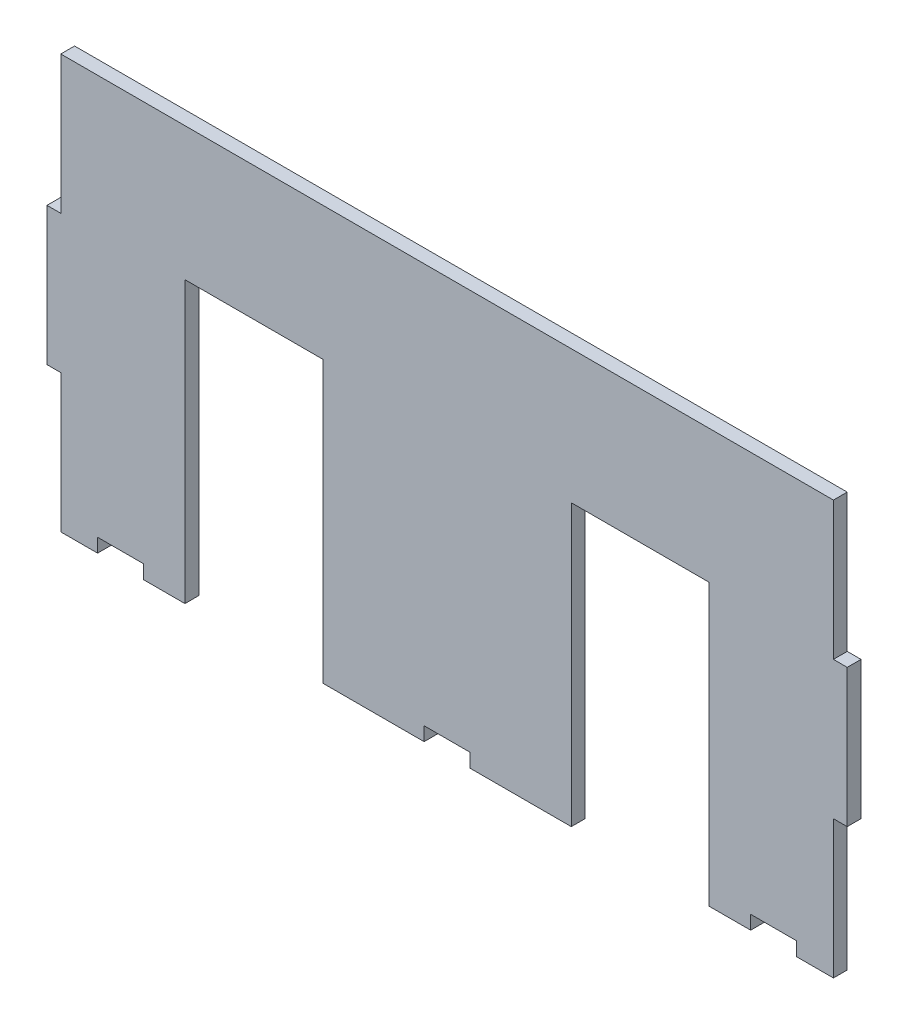
ISO-10303-21;
HEADER;
FILE_DESCRIPTION(('STEP AP214'),'2;1');
FILE_NAME('part.step','',(''),(''),'','','');
FILE_SCHEMA(('AUTOMOTIVE_DESIGN { 1 0 10303 214 1 1 1 1 }'));
ENDSEC;
DATA;
#1=APPLICATION_CONTEXT('core data for automotive mechanical design processes');
#2=APPLICATION_PROTOCOL_DEFINITION('international standard','automotive_design',2000,#1);
#3=PRODUCT_CONTEXT('',#1,'mechanical');
#4=PRODUCT('Part','Part','',(#3));
#5=PRODUCT_RELATED_PRODUCT_CATEGORY('part','',(#4));
#6=PRODUCT_DEFINITION_FORMATION('','',#4);
#7=PRODUCT_DEFINITION_CONTEXT('part definition',#1,'design');
#8=PRODUCT_DEFINITION('design','',#6,#7);
#9=PRODUCT_DEFINITION_SHAPE('','',#8);
#10=(LENGTH_UNIT() NAMED_UNIT(*) SI_UNIT(.MILLI.,.METRE.));
#11=(NAMED_UNIT(*) PLANE_ANGLE_UNIT() SI_UNIT($,.RADIAN.));
#12=(NAMED_UNIT(*) SI_UNIT($,.STERADIAN.) SOLID_ANGLE_UNIT());
#13=UNCERTAINTY_MEASURE_WITH_UNIT(LENGTH_MEASURE(1.E-05),#10,'distance_accuracy_value','');
#14=(GEOMETRIC_REPRESENTATION_CONTEXT(3) GLOBAL_UNCERTAINTY_ASSIGNED_CONTEXT((#13)) GLOBAL_UNIT_ASSIGNED_CONTEXT((#10,
#11,#12)) REPRESENTATION_CONTEXT('',''));
#15=CARTESIAN_POINT('',(0.,0.,0.));
#16=DIRECTION('',(0.,0.,1.));
#17=DIRECTION('',(1.,0.,0.));
#18=AXIS2_PLACEMENT_3D('',#15,#16,#17);
#19=CARTESIAN_POINT('',(322.190497343663,200.123752973223,3.));
#20=DIRECTION('',(0.,1.,0.));
#21=DIRECTION('',(-1.,0.,0.));
#22=AXIS2_PLACEMENT_3D('',#19,#20,#21);
#23=PLANE('',#22);
#24=DIRECTION('',(1.,0.,0.));
#25=VECTOR('',#24,1.);
#26=CARTESIAN_POINT('',(322.190497343663,200.123752973223,0.));
#27=LINE('',#26,#25);
#28=CARTESIAN_POINT('',(292.190497343663,200.123752973223,0.));
#29=VERTEX_POINT('',#28);
#30=CARTESIAN_POINT('',(322.190497343663,200.123752973223,0.));
#31=VERTEX_POINT('',#30);
#32=EDGE_CURVE('E273',#29,#31,#27,.T.);
#33=ORIENTED_EDGE('',*,*,#32,.T.);
#34=DIRECTION('',(0.,0.,-1.));
#35=VECTOR('',#34,1.);
#36=CARTESIAN_POINT('',(322.190497343663,200.123752973223,3.));
#37=LINE('',#36,#35);
#38=CARTESIAN_POINT('',(322.190497343663,200.123752973223,3.));
#39=VERTEX_POINT('',#38);
#40=EDGE_CURVE('E11',#39,#31,#37,.T.);
#41=ORIENTED_EDGE('',*,*,#40,.F.);
#42=DIRECTION('',(1.,0.,0.));
#43=VECTOR('',#42,1.);
#44=CARTESIAN_POINT('',(322.190497343663,200.123752973223,3.));
#45=LINE('',#44,#43);
#46=CARTESIAN_POINT('',(292.190497343663,200.123752973223,3.));
#47=VERTEX_POINT('',#46);
#48=EDGE_CURVE('E335',#47,#39,#45,.T.);
#49=ORIENTED_EDGE('',*,*,#48,.F.);
#50=DIRECTION('',(0.,0.,-1.));
#51=VECTOR('',#50,1.);
#52=CARTESIAN_POINT('',(292.190497343663,200.123752973223,3.));
#53=LINE('',#52,#51);
#54=EDGE_CURVE('E269',#47,#29,#53,.T.);
#55=ORIENTED_EDGE('',*,*,#54,.T.);
#56=EDGE_LOOP('',(#33,#41,#49,#55));
#57=FACE_BOUND('',#56,.T.);
#58=ADVANCED_FACE('F33',(#57),#23,.F.);
#59=CARTESIAN_POINT('',(322.190497343663,139.123752973223,3.));
#60=DIRECTION('',(1.,0.,0.));
#61=DIRECTION('',(0.,0.,-1.));
#62=AXIS2_PLACEMENT_3D('',#59,#60,#61);
#63=PLANE('',#62);
#64=DIRECTION('',(0.,-1.,0.));
#65=VECTOR('',#64,1.);
#66=CARTESIAN_POINT('',(322.190497343663,139.123752973223,0.));
#67=LINE('',#66,#65);
#68=CARTESIAN_POINT('',(322.190497343663,139.123752973223,0.));
#69=VERTEX_POINT('',#68);
#70=EDGE_CURVE('E276',#31,#69,#67,.T.);
#71=ORIENTED_EDGE('',*,*,#70,.T.);
#72=DIRECTION('',(0.,0.,-1.));
#73=VECTOR('',#72,1.);
#74=CARTESIAN_POINT('',(322.190497343663,139.123752973223,3.));
#75=LINE('',#74,#73);
#76=CARTESIAN_POINT('',(322.190497343663,139.123752973223,3.));
#77=VERTEX_POINT('',#76);
#78=EDGE_CURVE('E41',#77,#69,#75,.T.);
#79=ORIENTED_EDGE('',*,*,#78,.F.);
#80=DIRECTION('',(0.,-1.,0.));
#81=VECTOR('',#80,1.);
#82=CARTESIAN_POINT('',(322.190497343663,139.123752973223,3.));
#83=LINE('',#82,#81);
#84=EDGE_CURVE('E164',#39,#77,#83,.T.);
#85=ORIENTED_EDGE('',*,*,#84,.F.);
#86=ORIENTED_EDGE('',*,*,#40,.T.);
#87=EDGE_LOOP('',(#71,#79,#85,#86));
#88=FACE_BOUND('',#87,.T.);
#89=ADVANCED_FACE('F513',(#88),#63,.F.);
#90=CARTESIAN_POINT('',(322.190497343663,139.123752973223,3.));
#91=DIRECTION('',(0.,1.,0.));
#92=DIRECTION('',(-1.,0.,0.));
#93=AXIS2_PLACEMENT_3D('',#90,#91,#92);
#94=PLANE('',#93);
#95=DIRECTION('',(1.,0.,0.));
#96=VECTOR('',#95,1.);
#97=CARTESIAN_POINT('',(322.190497343663,139.123752973223,0.));
#98=LINE('',#97,#96);
#99=CARTESIAN_POINT('',(331.190497343663,139.123752973223,0.));
#100=VERTEX_POINT('',#99);
#101=EDGE_CURVE('E278',#69,#100,#98,.T.);
#102=ORIENTED_EDGE('',*,*,#101,.T.);
#103=DIRECTION('',(0.,0.,-1.));
#104=VECTOR('',#103,1.);
#105=CARTESIAN_POINT('',(331.190497343663,139.123752973223,3.));
#106=LINE('',#105,#104);
#107=CARTESIAN_POINT('',(331.190497343663,139.123752973223,3.));
#108=VERTEX_POINT('',#107);
#109=EDGE_CURVE('E414',#108,#100,#106,.T.);
#110=ORIENTED_EDGE('',*,*,#109,.F.);
#111=DIRECTION('',(1.,0.,0.));
#112=VECTOR('',#111,1.);
#113=CARTESIAN_POINT('',(322.190497343663,139.123752973223,3.));
#114=LINE('',#113,#112);
#115=EDGE_CURVE('E422',#77,#108,#114,.T.);
#116=ORIENTED_EDGE('',*,*,#115,.F.);
#117=ORIENTED_EDGE('',*,*,#78,.T.);
#118=EDGE_LOOP('',(#102,#110,#116,#117));
#119=FACE_BOUND('',#118,.T.);
#120=ADVANCED_FACE('F420',(#119),#94,.F.);
#121=CARTESIAN_POINT('',(331.190497343663,139.123752973223,3.));
#122=DIRECTION('',(-1.,0.,0.));
#123=DIRECTION('',(0.,0.,1.));
#124=AXIS2_PLACEMENT_3D('',#121,#122,#123);
#125=PLANE('',#124);
#126=DIRECTION('',(0.,1.,0.));
#127=VECTOR('',#126,1.);
#128=CARTESIAN_POINT('',(331.190497343663,139.123752973223,0.));
#129=LINE('',#128,#127);
#130=CARTESIAN_POINT('',(331.190497343663,142.123752973223,0.));
#131=VERTEX_POINT('',#130);
#132=EDGE_CURVE('E280',#100,#131,#129,.T.);
#133=ORIENTED_EDGE('',*,*,#132,.T.);
#134=DIRECTION('',(0.,0.,-1.));
#135=VECTOR('',#134,1.);
#136=CARTESIAN_POINT('',(331.190497343663,142.123752973223,3.));
#137=LINE('',#136,#135);
#138=CARTESIAN_POINT('',(331.190497343663,142.123752973223,3.));
#139=VERTEX_POINT('',#138);
#140=EDGE_CURVE('E411',#139,#131,#137,.T.);
#141=ORIENTED_EDGE('',*,*,#140,.F.);
#142=DIRECTION('',(0.,1.,0.));
#143=VECTOR('',#142,1.);
#144=CARTESIAN_POINT('',(331.190497343663,139.123752973223,3.));
#145=LINE('',#144,#143);
#146=EDGE_CURVE('E440',#108,#139,#145,.T.);
#147=ORIENTED_EDGE('',*,*,#146,.F.);
#148=ORIENTED_EDGE('',*,*,#109,.T.);
#149=EDGE_LOOP('',(#133,#141,#147,#148));
#150=FACE_BOUND('',#149,.T.);
#151=ADVANCED_FACE('F431',(#150),#125,.F.);
#152=CARTESIAN_POINT('',(331.190497343663,142.123752973223,3.));
#153=DIRECTION('',(0.,1.,0.));
#154=DIRECTION('',(-1.,0.,0.));
#155=AXIS2_PLACEMENT_3D('',#152,#153,#154);
#156=PLANE('',#155);
#157=DIRECTION('',(1.,0.,0.));
#158=VECTOR('',#157,1.);
#159=CARTESIAN_POINT('',(331.190497343663,142.123752973223,0.));
#160=LINE('',#159,#158);
#161=CARTESIAN_POINT('',(341.190497343663,142.123752973223,0.));
#162=VERTEX_POINT('',#161);
#163=EDGE_CURVE('E282',#131,#162,#160,.T.);
#164=ORIENTED_EDGE('',*,*,#163,.T.);
#165=DIRECTION('',(0.,0.,-1.));
#166=VECTOR('',#165,1.);
#167=CARTESIAN_POINT('',(341.190497343663,142.123752973223,3.));
#168=LINE('',#167,#166);
#169=CARTESIAN_POINT('',(341.190497343663,142.123752973223,3.));
#170=VERTEX_POINT('',#169);
#171=EDGE_CURVE('E408',#170,#162,#168,.T.);
#172=ORIENTED_EDGE('',*,*,#171,.F.);
#173=DIRECTION('',(1.,0.,0.));
#174=VECTOR('',#173,1.);
#175=CARTESIAN_POINT('',(331.190497343663,142.123752973223,3.));
#176=LINE('',#175,#174);
#177=EDGE_CURVE('E437',#139,#170,#176,.T.);
#178=ORIENTED_EDGE('',*,*,#177,.F.);
#179=ORIENTED_EDGE('',*,*,#140,.T.);
#180=EDGE_LOOP('',(#164,#172,#178,#179));
#181=FACE_BOUND('',#180,.T.);
#182=ADVANCED_FACE('F435',(#181),#156,.F.);
#183=CARTESIAN_POINT('',(341.190497343663,142.123752973223,3.));
#184=DIRECTION('',(1.,0.,0.));
#185=DIRECTION('',(0.,0.,-1.));
#186=AXIS2_PLACEMENT_3D('',#183,#184,#185);
#187=PLANE('',#186);
#188=DIRECTION('',(0.,-1.,0.));
#189=VECTOR('',#188,1.);
#190=CARTESIAN_POINT('',(341.190497343663,142.123752973223,0.));
#191=LINE('',#190,#189);
#192=CARTESIAN_POINT('',(341.190497343663,139.123752973223,0.));
#193=VERTEX_POINT('',#192);
#194=EDGE_CURVE('E284',#162,#193,#191,.T.);
#195=ORIENTED_EDGE('',*,*,#194,.T.);
#196=DIRECTION('',(0.,0.,-1.));
#197=VECTOR('',#196,1.);
#198=CARTESIAN_POINT('',(341.190497343663,139.123752973223,3.));
#199=LINE('',#198,#197);
#200=CARTESIAN_POINT('',(341.190497343663,139.123752973223,3.));
#201=VERTEX_POINT('',#200);
#202=EDGE_CURVE('E405',#201,#193,#199,.T.);
#203=ORIENTED_EDGE('',*,*,#202,.F.);
#204=DIRECTION('',(0.,-1.,0.));
#205=VECTOR('',#204,1.);
#206=CARTESIAN_POINT('',(341.190497343663,142.123752973223,3.));
#207=LINE('',#206,#205);
#208=EDGE_CURVE('E439',#170,#201,#207,.T.);
#209=ORIENTED_EDGE('',*,*,#208,.F.);
#210=ORIENTED_EDGE('',*,*,#171,.T.);
#211=EDGE_LOOP('',(#195,#203,#209,#210));
#212=FACE_BOUND('',#211,.T.);
#213=ADVANCED_FACE('F526',(#212),#187,.F.);
#214=CARTESIAN_POINT('',(341.190497343663,139.123752973223,3.));
#215=DIRECTION('',(0.,1.,0.));
#216=DIRECTION('',(-1.,0.,0.));
#217=AXIS2_PLACEMENT_3D('',#214,#215,#216);
#218=PLANE('',#217);
#219=DIRECTION('',(1.,0.,0.));
#220=VECTOR('',#219,1.);
#221=CARTESIAN_POINT('',(341.190497343663,139.123752973223,0.));
#222=LINE('',#221,#220);
#223=CARTESIAN_POINT('',(349.190497343663,139.123752973223,0.));
#224=VERTEX_POINT('',#223);
#225=EDGE_CURVE('E286',#193,#224,#222,.T.);
#226=ORIENTED_EDGE('',*,*,#225,.T.);
#227=DIRECTION('',(0.,0.,-1.));
#228=VECTOR('',#227,1.);
#229=CARTESIAN_POINT('',(349.190497343663,139.123752973223,3.));
#230=LINE('',#229,#228);
#231=CARTESIAN_POINT('',(349.190497343663,139.123752973223,3.));
#232=VERTEX_POINT('',#231);
#233=EDGE_CURVE('E402',#232,#224,#230,.T.);
#234=ORIENTED_EDGE('',*,*,#233,.F.);
#235=DIRECTION('',(1.,0.,0.));
#236=VECTOR('',#235,1.);
#237=CARTESIAN_POINT('',(341.190497343663,139.123752973223,3.));
#238=LINE('',#237,#236);
#239=EDGE_CURVE('E442',#201,#232,#238,.T.);
#240=ORIENTED_EDGE('',*,*,#239,.F.);
#241=ORIENTED_EDGE('',*,*,#202,.T.);
#242=EDGE_LOOP('',(#226,#234,#240,#241));
#243=FACE_BOUND('',#242,.T.);
#244=ADVANCED_FACE('F529',(#243),#218,.F.);
#245=CARTESIAN_POINT('',(349.190497343663,169.123752973223,3.));
#246=DIRECTION('',(-1.,0.,0.));
#247=DIRECTION('',(0.,0.,1.));
#248=AXIS2_PLACEMENT_3D('',#245,#246,#247);
#249=PLANE('',#248);
#250=DIRECTION('',(0.,1.,0.));
#251=VECTOR('',#250,1.);
#252=CARTESIAN_POINT('',(349.190497343663,169.123752973223,0.));
#253=LINE('',#252,#251);
#254=CARTESIAN_POINT('',(349.190497343663,169.123752973223,0.));
#255=VERTEX_POINT('',#254);
#256=EDGE_CURVE('E288',#224,#255,#253,.T.);
#257=ORIENTED_EDGE('',*,*,#256,.T.);
#258=DIRECTION('',(0.,0.,-1.));
#259=VECTOR('',#258,1.);
#260=CARTESIAN_POINT('',(349.190497343663,169.123752973223,3.));
#261=LINE('',#260,#259);
#262=CARTESIAN_POINT('',(349.190497343663,169.123752973223,3.));
#263=VERTEX_POINT('',#262);
#264=EDGE_CURVE('E399',#263,#255,#261,.T.);
#265=ORIENTED_EDGE('',*,*,#264,.F.);
#266=DIRECTION('',(0.,1.,0.));
#267=VECTOR('',#266,1.);
#268=CARTESIAN_POINT('',(349.190497343663,169.123752973223,3.));
#269=LINE('',#268,#267);
#270=EDGE_CURVE('E448',#232,#263,#269,.T.);
#271=ORIENTED_EDGE('',*,*,#270,.F.);
#272=ORIENTED_EDGE('',*,*,#233,.T.);
#273=EDGE_LOOP('',(#257,#265,#271,#272));
#274=FACE_BOUND('',#273,.T.);
#275=ADVANCED_FACE('F533',(#274),#249,.F.);
#276=CARTESIAN_POINT('',(352.190497343663,169.123752973223,3.));
#277=DIRECTION('',(0.,1.,0.));
#278=DIRECTION('',(-1.,0.,0.));
#279=AXIS2_PLACEMENT_3D('',#276,#277,#278);
#280=PLANE('',#279);
#281=DIRECTION('',(1.,0.,0.));
#282=VECTOR('',#281,1.);
#283=CARTESIAN_POINT('',(352.190497343663,169.123752973223,0.));
#284=LINE('',#283,#282);
#285=CARTESIAN_POINT('',(352.190497343663,169.123752973223,0.));
#286=VERTEX_POINT('',#285);
#287=EDGE_CURVE('E290',#255,#286,#284,.T.);
#288=ORIENTED_EDGE('',*,*,#287,.T.);
#289=DIRECTION('',(0.,0.,-1.));
#290=VECTOR('',#289,1.);
#291=CARTESIAN_POINT('',(352.190497343663,169.123752973223,3.));
#292=LINE('',#291,#290);
#293=CARTESIAN_POINT('',(352.190497343663,169.123752973223,3.));
#294=VERTEX_POINT('',#293);
#295=EDGE_CURVE('E396',#294,#286,#292,.T.);
#296=ORIENTED_EDGE('',*,*,#295,.F.);
#297=DIRECTION('',(1.,0.,0.));
#298=VECTOR('',#297,1.);
#299=CARTESIAN_POINT('',(352.190497343663,169.123752973223,3.));
#300=LINE('',#299,#298);
#301=EDGE_CURVE('E450',#263,#294,#300,.T.);
#302=ORIENTED_EDGE('',*,*,#301,.F.);
#303=ORIENTED_EDGE('',*,*,#264,.T.);
#304=EDGE_LOOP('',(#288,#296,#302,#303));
#305=FACE_BOUND('',#304,.T.);
#306=ADVANCED_FACE('F537',(#305),#280,.F.);
#307=CARTESIAN_POINT('',(352.190497343663,199.123752973223,3.));
#308=DIRECTION('',(-1.,0.,0.));
#309=DIRECTION('',(0.,-1.,0.));
#310=AXIS2_PLACEMENT_3D('',#307,#308,#309);
#311=PLANE('',#310);
#312=DIRECTION('',(0.,1.,0.));
#313=VECTOR('',#312,1.);
#314=CARTESIAN_POINT('',(352.190497343663,199.123752973223,0.));
#315=LINE('',#314,#313);
#316=CARTESIAN_POINT('',(352.190497343663,199.123752973223,0.));
#317=VERTEX_POINT('',#316);
#318=EDGE_CURVE('E292',#286,#317,#315,.T.);
#319=ORIENTED_EDGE('',*,*,#318,.T.);
#320=DIRECTION('',(0.,0.,-1.));
#321=VECTOR('',#320,1.);
#322=CARTESIAN_POINT('',(352.190497343663,199.123752973223,3.));
#323=LINE('',#322,#321);
#324=CARTESIAN_POINT('',(352.190497343663,199.123752973223,3.));
#325=VERTEX_POINT('',#324);
#326=EDGE_CURVE('E393',#325,#317,#323,.T.);
#327=ORIENTED_EDGE('',*,*,#326,.F.);
#328=DIRECTION('',(0.,1.,0.));
#329=VECTOR('',#328,1.);
#330=CARTESIAN_POINT('',(352.190497343663,199.123752973223,3.));
#331=LINE('',#330,#329);
#332=EDGE_CURVE('E452',#294,#325,#331,.T.);
#333=ORIENTED_EDGE('',*,*,#332,.F.);
#334=ORIENTED_EDGE('',*,*,#295,.T.);
#335=EDGE_LOOP('',(#319,#327,#333,#334));
#336=FACE_BOUND('',#335,.T.);
#337=ADVANCED_FACE('F541',(#336),#311,.F.);
#338=CARTESIAN_POINT('',(349.190497343663,199.123752973223,3.));
#339=DIRECTION('',(0.,-1.,0.));
#340=DIRECTION('',(1.,0.,0.));
#341=AXIS2_PLACEMENT_3D('',#338,#339,#340);
#342=PLANE('',#341);
#343=DIRECTION('',(-1.,0.,0.));
#344=VECTOR('',#343,1.);
#345=CARTESIAN_POINT('',(349.190497343663,199.123752973223,0.));
#346=LINE('',#345,#344);
#347=CARTESIAN_POINT('',(349.190497343663,199.123752973223,0.));
#348=VERTEX_POINT('',#347);
#349=EDGE_CURVE('E294',#317,#348,#346,.T.);
#350=ORIENTED_EDGE('',*,*,#349,.T.);
#351=DIRECTION('',(0.,0.,-1.));
#352=VECTOR('',#351,1.);
#353=CARTESIAN_POINT('',(349.190497343663,199.123752973223,3.));
#354=LINE('',#353,#352);
#355=CARTESIAN_POINT('',(349.190497343663,199.123752973223,3.));
#356=VERTEX_POINT('',#355);
#357=EDGE_CURVE('E390',#356,#348,#354,.T.);
#358=ORIENTED_EDGE('',*,*,#357,.F.);
#359=DIRECTION('',(-1.,0.,0.));
#360=VECTOR('',#359,1.);
#361=CARTESIAN_POINT('',(349.190497343663,199.123752973223,3.));
#362=LINE('',#361,#360);
#363=EDGE_CURVE('E454',#325,#356,#362,.T.);
#364=ORIENTED_EDGE('',*,*,#363,.F.);
#365=ORIENTED_EDGE('',*,*,#326,.T.);
#366=EDGE_LOOP('',(#350,#358,#364,#365));
#367=FACE_BOUND('',#366,.T.);
#368=ADVANCED_FACE('F545',(#367),#342,.F.);
#369=CARTESIAN_POINT('',(349.190497343663,229.123752973223,3.));
#370=DIRECTION('',(-1.,0.,0.));
#371=DIRECTION('',(0.,-1.,0.));
#372=AXIS2_PLACEMENT_3D('',#369,#370,#371);
#373=PLANE('',#372);
#374=DIRECTION('',(0.,1.,0.));
#375=VECTOR('',#374,1.);
#376=CARTESIAN_POINT('',(349.190497343663,229.123752973223,0.));
#377=LINE('',#376,#375);
#378=CARTESIAN_POINT('',(349.190497343663,229.123752973223,0.));
#379=VERTEX_POINT('',#378);
#380=EDGE_CURVE('E296',#348,#379,#377,.T.);
#381=ORIENTED_EDGE('',*,*,#380,.T.);
#382=DIRECTION('',(0.,0.,-1.));
#383=VECTOR('',#382,1.);
#384=CARTESIAN_POINT('',(349.190497343663,229.123752973223,3.));
#385=LINE('',#384,#383);
#386=CARTESIAN_POINT('',(349.190497343663,229.123752973223,3.));
#387=VERTEX_POINT('',#386);
#388=EDGE_CURVE('E387',#387,#379,#385,.T.);
#389=ORIENTED_EDGE('',*,*,#388,.F.);
#390=DIRECTION('',(0.,1.,0.));
#391=VECTOR('',#390,1.);
#392=CARTESIAN_POINT('',(349.190497343663,229.123752973223,3.));
#393=LINE('',#392,#391);
#394=EDGE_CURVE('E456',#356,#387,#393,.T.);
#395=ORIENTED_EDGE('',*,*,#394,.F.);
#396=ORIENTED_EDGE('',*,*,#357,.T.);
#397=EDGE_LOOP('',(#381,#389,#395,#396));
#398=FACE_BOUND('',#397,.T.);
#399=ADVANCED_FACE('F549',(#398),#373,.F.);
#400=CARTESIAN_POINT('',(181.190497343663,229.123752973223,3.));
#401=DIRECTION('',(0.,-1.,0.));
#402=DIRECTION('',(1.,0.,0.));
#403=AXIS2_PLACEMENT_3D('',#400,#401,#402);
#404=PLANE('',#403);
#405=DIRECTION('',(-1.,0.,0.));
#406=VECTOR('',#405,1.);
#407=CARTESIAN_POINT('',(181.190497343663,229.123752973223,0.));
#408=LINE('',#407,#406);
#409=CARTESIAN_POINT('',(181.190497343663,229.123752973223,0.));
#410=VERTEX_POINT('',#409);
#411=EDGE_CURVE('E298',#379,#410,#408,.T.);
#412=ORIENTED_EDGE('',*,*,#411,.T.);
#413=DIRECTION('',(0.,0.,-1.));
#414=VECTOR('',#413,1.);
#415=CARTESIAN_POINT('',(181.190497343663,229.123752973223,3.));
#416=LINE('',#415,#414);
#417=CARTESIAN_POINT('',(181.190497343663,229.123752973223,3.));
#418=VERTEX_POINT('',#417);
#419=EDGE_CURVE('E384',#418,#410,#416,.T.);
#420=ORIENTED_EDGE('',*,*,#419,.F.);
#421=DIRECTION('',(-1.,0.,0.));
#422=VECTOR('',#421,1.);
#423=CARTESIAN_POINT('',(181.190497343663,229.123752973223,3.));
#424=LINE('',#423,#422);
#425=EDGE_CURVE('E458',#387,#418,#424,.T.);
#426=ORIENTED_EDGE('',*,*,#425,.F.);
#427=ORIENTED_EDGE('',*,*,#388,.T.);
#428=EDGE_LOOP('',(#412,#420,#426,#427));
#429=FACE_BOUND('',#428,.T.);
#430=ADVANCED_FACE('F553',(#429),#404,.F.);
#431=CARTESIAN_POINT('',(181.190497343663,199.123752973223,3.));
#432=DIRECTION('',(1.,0.,0.));
#433=DIRECTION('',(0.,0.,-1.));
#434=AXIS2_PLACEMENT_3D('',#431,#432,#433);
#435=PLANE('',#434);
#436=DIRECTION('',(0.,-1.,0.));
#437=VECTOR('',#436,1.);
#438=CARTESIAN_POINT('',(181.190497343663,199.123752973223,0.));
#439=LINE('',#438,#437);
#440=CARTESIAN_POINT('',(181.190497343663,199.123752973223,0.));
#441=VERTEX_POINT('',#440);
#442=EDGE_CURVE('E300',#410,#441,#439,.T.);
#443=ORIENTED_EDGE('',*,*,#442,.T.);
#444=DIRECTION('',(0.,0.,-1.));
#445=VECTOR('',#444,1.);
#446=CARTESIAN_POINT('',(181.190497343663,199.123752973223,3.));
#447=LINE('',#446,#445);
#448=CARTESIAN_POINT('',(181.190497343663,199.123752973223,3.));
#449=VERTEX_POINT('',#448);
#450=EDGE_CURVE('E381',#449,#441,#447,.T.);
#451=ORIENTED_EDGE('',*,*,#450,.F.);
#452=DIRECTION('',(0.,-1.,0.));
#453=VECTOR('',#452,1.);
#454=CARTESIAN_POINT('',(181.190497343663,199.123752973223,3.));
#455=LINE('',#454,#453);
#456=EDGE_CURVE('E460',#418,#449,#455,.T.);
#457=ORIENTED_EDGE('',*,*,#456,.F.);
#458=ORIENTED_EDGE('',*,*,#419,.T.);
#459=EDGE_LOOP('',(#443,#451,#457,#458));
#460=FACE_BOUND('',#459,.T.);
#461=ADVANCED_FACE('F557',(#460),#435,.F.);
#462=CARTESIAN_POINT('',(178.190497343663,199.123752973223,3.));
#463=DIRECTION('',(0.,-1.,0.));
#464=DIRECTION('',(0.,0.,-1.));
#465=AXIS2_PLACEMENT_3D('',#462,#463,#464);
#466=PLANE('',#465);
#467=DIRECTION('',(-1.,0.,0.));
#468=VECTOR('',#467,1.);
#469=CARTESIAN_POINT('',(178.190497343663,199.123752973223,0.));
#470=LINE('',#469,#468);
#471=CARTESIAN_POINT('',(178.190497343663,199.123752973223,0.));
#472=VERTEX_POINT('',#471);
#473=EDGE_CURVE('E302',#441,#472,#470,.T.);
#474=ORIENTED_EDGE('',*,*,#473,.T.);
#475=DIRECTION('',(0.,0.,-1.));
#476=VECTOR('',#475,1.);
#477=CARTESIAN_POINT('',(178.190497343663,199.123752973223,3.));
#478=LINE('',#477,#476);
#479=CARTESIAN_POINT('',(178.190497343663,199.123752973223,3.));
#480=VERTEX_POINT('',#479);
#481=EDGE_CURVE('E378',#480,#472,#478,.T.);
#482=ORIENTED_EDGE('',*,*,#481,.F.);
#483=DIRECTION('',(-1.,0.,0.));
#484=VECTOR('',#483,1.);
#485=CARTESIAN_POINT('',(178.190497343663,199.123752973223,3.));
#486=LINE('',#485,#484);
#487=EDGE_CURVE('E462',#449,#480,#486,.T.);
#488=ORIENTED_EDGE('',*,*,#487,.F.);
#489=ORIENTED_EDGE('',*,*,#450,.T.);
#490=EDGE_LOOP('',(#474,#482,#488,#489));
#491=FACE_BOUND('',#490,.T.);
#492=ADVANCED_FACE('F561',(#491),#466,.F.);
#493=CARTESIAN_POINT('',(178.190497343663,199.123752973223,3.));
#494=DIRECTION('',(1.,0.,0.));
#495=DIRECTION('',(0.,0.,-1.));
#496=AXIS2_PLACEMENT_3D('',#493,#494,#495);
#497=PLANE('',#496);
#498=DIRECTION('',(0.,-1.,0.));
#499=VECTOR('',#498,1.);
#500=CARTESIAN_POINT('',(178.190497343663,199.123752973223,0.));
#501=LINE('',#500,#499);
#502=CARTESIAN_POINT('',(178.190497343663,169.123752973223,0.));
#503=VERTEX_POINT('',#502);
#504=EDGE_CURVE('E304',#472,#503,#501,.T.);
#505=ORIENTED_EDGE('',*,*,#504,.T.);
#506=DIRECTION('',(0.,0.,-1.));
#507=VECTOR('',#506,1.);
#508=CARTESIAN_POINT('',(178.190497343663,169.123752973223,3.));
#509=LINE('',#508,#507);
#510=CARTESIAN_POINT('',(178.190497343663,169.123752973223,3.));
#511=VERTEX_POINT('',#510);
#512=EDGE_CURVE('E375',#511,#503,#509,.T.);
#513=ORIENTED_EDGE('',*,*,#512,.F.);
#514=DIRECTION('',(0.,-1.,0.));
#515=VECTOR('',#514,1.);
#516=CARTESIAN_POINT('',(178.190497343663,199.123752973223,3.));
#517=LINE('',#516,#515);
#518=EDGE_CURVE('E464',#480,#511,#517,.T.);
#519=ORIENTED_EDGE('',*,*,#518,.F.);
#520=ORIENTED_EDGE('',*,*,#481,.T.);
#521=EDGE_LOOP('',(#505,#513,#519,#520));
#522=FACE_BOUND('',#521,.T.);
#523=ADVANCED_FACE('F565',(#522),#497,.F.);
#524=CARTESIAN_POINT('',(181.190497343663,169.123752973223,3.));
#525=DIRECTION('',(0.,1.,0.));
#526=DIRECTION('',(-1.,0.,0.));
#527=AXIS2_PLACEMENT_3D('',#524,#525,#526);
#528=PLANE('',#527);
#529=DIRECTION('',(1.,0.,0.));
#530=VECTOR('',#529,1.);
#531=CARTESIAN_POINT('',(181.190497343663,169.123752973223,0.));
#532=LINE('',#531,#530);
#533=CARTESIAN_POINT('',(181.190497343663,169.123752973223,0.));
#534=VERTEX_POINT('',#533);
#535=EDGE_CURVE('E306',#503,#534,#532,.T.);
#536=ORIENTED_EDGE('',*,*,#535,.T.);
#537=DIRECTION('',(0.,0.,-1.));
#538=VECTOR('',#537,1.);
#539=CARTESIAN_POINT('',(181.190497343663,169.123752973223,3.));
#540=LINE('',#539,#538);
#541=CARTESIAN_POINT('',(181.190497343663,169.123752973223,3.));
#542=VERTEX_POINT('',#541);
#543=EDGE_CURVE('E372',#542,#534,#540,.T.);
#544=ORIENTED_EDGE('',*,*,#543,.F.);
#545=DIRECTION('',(1.,0.,0.));
#546=VECTOR('',#545,1.);
#547=CARTESIAN_POINT('',(181.190497343663,169.123752973223,3.));
#548=LINE('',#547,#546);
#549=EDGE_CURVE('E466',#511,#542,#548,.T.);
#550=ORIENTED_EDGE('',*,*,#549,.F.);
#551=ORIENTED_EDGE('',*,*,#512,.T.);
#552=EDGE_LOOP('',(#536,#544,#550,#551));
#553=FACE_BOUND('',#552,.T.);
#554=ADVANCED_FACE('F569',(#553),#528,.F.);
#555=CARTESIAN_POINT('',(181.190497343663,139.123752973223,3.));
#556=DIRECTION('',(1.,0.,0.));
#557=DIRECTION('',(0.,0.,-1.));
#558=AXIS2_PLACEMENT_3D('',#555,#556,#557);
#559=PLANE('',#558);
#560=DIRECTION('',(0.,-1.,0.));
#561=VECTOR('',#560,1.);
#562=CARTESIAN_POINT('',(181.190497343663,139.123752973223,0.));
#563=LINE('',#562,#561);
#564=CARTESIAN_POINT('',(181.190497343663,139.123752973223,0.));
#565=VERTEX_POINT('',#564);
#566=EDGE_CURVE('E308',#534,#565,#563,.T.);
#567=ORIENTED_EDGE('',*,*,#566,.T.);
#568=DIRECTION('',(0.,0.,-1.));
#569=VECTOR('',#568,1.);
#570=CARTESIAN_POINT('',(181.190497343663,139.123752973223,3.));
#571=LINE('',#570,#569);
#572=CARTESIAN_POINT('',(181.190497343663,139.123752973223,3.));
#573=VERTEX_POINT('',#572);
#574=EDGE_CURVE('E369',#573,#565,#571,.T.);
#575=ORIENTED_EDGE('',*,*,#574,.F.);
#576=DIRECTION('',(0.,-1.,0.));
#577=VECTOR('',#576,1.);
#578=CARTESIAN_POINT('',(181.190497343663,139.123752973223,3.));
#579=LINE('',#578,#577);
#580=EDGE_CURVE('E468',#542,#573,#579,.T.);
#581=ORIENTED_EDGE('',*,*,#580,.F.);
#582=ORIENTED_EDGE('',*,*,#543,.T.);
#583=EDGE_LOOP('',(#567,#575,#581,#582));
#584=FACE_BOUND('',#583,.T.);
#585=ADVANCED_FACE('F573',(#584),#559,.F.);
#586=CARTESIAN_POINT('',(181.190497343663,139.123752973223,3.));
#587=DIRECTION('',(0.,1.,0.));
#588=DIRECTION('',(0.,0.,1.));
#589=AXIS2_PLACEMENT_3D('',#586,#587,#588);
#590=PLANE('',#589);
#591=DIRECTION('',(1.,0.,0.));
#592=VECTOR('',#591,1.);
#593=CARTESIAN_POINT('',(181.190497343663,139.123752973223,0.));
#594=LINE('',#593,#592);
#595=CARTESIAN_POINT('',(189.190497343663,139.123752973223,0.));
#596=VERTEX_POINT('',#595);
#597=EDGE_CURVE('E310',#565,#596,#594,.T.);
#598=ORIENTED_EDGE('',*,*,#597,.T.);
#599=DIRECTION('',(0.,0.,-1.));
#600=VECTOR('',#599,1.);
#601=CARTESIAN_POINT('',(189.190497343663,139.123752973223,3.));
#602=LINE('',#601,#600);
#603=CARTESIAN_POINT('',(189.190497343663,139.123752973223,3.));
#604=VERTEX_POINT('',#603);
#605=EDGE_CURVE('E366',#604,#596,#602,.T.);
#606=ORIENTED_EDGE('',*,*,#605,.F.);
#607=DIRECTION('',(1.,0.,0.));
#608=VECTOR('',#607,1.);
#609=CARTESIAN_POINT('',(181.190497343663,139.123752973223,3.));
#610=LINE('',#609,#608);
#611=EDGE_CURVE('E470',#573,#604,#610,.T.);
#612=ORIENTED_EDGE('',*,*,#611,.F.);
#613=ORIENTED_EDGE('',*,*,#574,.T.);
#614=EDGE_LOOP('',(#598,#606,#612,#613));
#615=FACE_BOUND('',#614,.T.);
#616=ADVANCED_FACE('F577',(#615),#590,.F.);
#617=CARTESIAN_POINT('',(189.190497343663,139.123752973223,3.));
#618=DIRECTION('',(-1.,0.,0.));
#619=DIRECTION('',(0.,0.,1.));
#620=AXIS2_PLACEMENT_3D('',#617,#618,#619);
#621=PLANE('',#620);
#622=DIRECTION('',(0.,1.,0.));
#623=VECTOR('',#622,1.);
#624=CARTESIAN_POINT('',(189.190497343663,139.123752973223,0.));
#625=LINE('',#624,#623);
#626=CARTESIAN_POINT('',(189.190497343663,142.123752973223,0.));
#627=VERTEX_POINT('',#626);
#628=EDGE_CURVE('E312',#596,#627,#625,.T.);
#629=ORIENTED_EDGE('',*,*,#628,.T.);
#630=DIRECTION('',(0.,0.,-1.));
#631=VECTOR('',#630,1.);
#632=CARTESIAN_POINT('',(189.190497343663,142.123752973223,3.));
#633=LINE('',#632,#631);
#634=CARTESIAN_POINT('',(189.190497343663,142.123752973223,3.));
#635=VERTEX_POINT('',#634);
#636=EDGE_CURVE('E363',#635,#627,#633,.T.);
#637=ORIENTED_EDGE('',*,*,#636,.F.);
#638=DIRECTION('',(0.,1.,0.));
#639=VECTOR('',#638,1.);
#640=CARTESIAN_POINT('',(189.190497343663,139.123752973223,3.));
#641=LINE('',#640,#639);
#642=EDGE_CURVE('E472',#604,#635,#641,.T.);
#643=ORIENTED_EDGE('',*,*,#642,.F.);
#644=ORIENTED_EDGE('',*,*,#605,.T.);
#645=EDGE_LOOP('',(#629,#637,#643,#644));
#646=FACE_BOUND('',#645,.T.);
#647=ADVANCED_FACE('F581',(#646),#621,.F.);
#648=CARTESIAN_POINT('',(189.190497343663,142.123752973223,3.));
#649=DIRECTION('',(0.,1.,0.));
#650=DIRECTION('',(0.,0.,1.));
#651=AXIS2_PLACEMENT_3D('',#648,#649,#650);
#652=PLANE('',#651);
#653=DIRECTION('',(1.,0.,0.));
#654=VECTOR('',#653,1.);
#655=CARTESIAN_POINT('',(189.190497343663,142.123752973223,0.));
#656=LINE('',#655,#654);
#657=CARTESIAN_POINT('',(199.190497343663,142.123752973223,0.));
#658=VERTEX_POINT('',#657);
#659=EDGE_CURVE('E314',#627,#658,#656,.T.);
#660=ORIENTED_EDGE('',*,*,#659,.T.);
#661=DIRECTION('',(0.,0.,-1.));
#662=VECTOR('',#661,1.);
#663=CARTESIAN_POINT('',(199.190497343663,142.123752973223,3.));
#664=LINE('',#663,#662);
#665=CARTESIAN_POINT('',(199.190497343663,142.123752973223,3.));
#666=VERTEX_POINT('',#665);
#667=EDGE_CURVE('E360',#666,#658,#664,.T.);
#668=ORIENTED_EDGE('',*,*,#667,.F.);
#669=DIRECTION('',(1.,0.,0.));
#670=VECTOR('',#669,1.);
#671=CARTESIAN_POINT('',(189.190497343663,142.123752973223,3.));
#672=LINE('',#671,#670);
#673=EDGE_CURVE('E474',#635,#666,#672,.T.);
#674=ORIENTED_EDGE('',*,*,#673,.F.);
#675=ORIENTED_EDGE('',*,*,#636,.T.);
#676=EDGE_LOOP('',(#660,#668,#674,#675));
#677=FACE_BOUND('',#676,.T.);
#678=ADVANCED_FACE('F585',(#677),#652,.F.);
#679=CARTESIAN_POINT('',(199.190497343663,139.123752973223,3.));
#680=DIRECTION('',(1.,0.,0.));
#681=DIRECTION('',(0.,0.,-1.));
#682=AXIS2_PLACEMENT_3D('',#679,#680,#681);
#683=PLANE('',#682);
#684=DIRECTION('',(0.,-1.,0.));
#685=VECTOR('',#684,1.);
#686=CARTESIAN_POINT('',(199.190497343663,139.123752973223,0.));
#687=LINE('',#686,#685);
#688=CARTESIAN_POINT('',(199.190497343663,139.123752973223,0.));
#689=VERTEX_POINT('',#688);
#690=EDGE_CURVE('E316',#658,#689,#687,.T.);
#691=ORIENTED_EDGE('',*,*,#690,.T.);
#692=DIRECTION('',(0.,0.,-1.));
#693=VECTOR('',#692,1.);
#694=CARTESIAN_POINT('',(199.190497343663,139.123752973223,3.));
#695=LINE('',#694,#693);
#696=CARTESIAN_POINT('',(199.190497343663,139.123752973223,3.));
#697=VERTEX_POINT('',#696);
#698=EDGE_CURVE('E357',#697,#689,#695,.T.);
#699=ORIENTED_EDGE('',*,*,#698,.F.);
#700=DIRECTION('',(0.,-1.,0.));
#701=VECTOR('',#700,1.);
#702=CARTESIAN_POINT('',(199.190497343663,139.123752973223,3.));
#703=LINE('',#702,#701);
#704=EDGE_CURVE('E476',#666,#697,#703,.T.);
#705=ORIENTED_EDGE('',*,*,#704,.F.);
#706=ORIENTED_EDGE('',*,*,#667,.T.);
#707=EDGE_LOOP('',(#691,#699,#705,#706));
#708=FACE_BOUND('',#707,.T.);
#709=ADVANCED_FACE('F589',(#708),#683,.F.);
#710=CARTESIAN_POINT('',(208.190497343663,139.123752973223,3.));
#711=DIRECTION('',(0.,1.,0.));
#712=DIRECTION('',(0.,0.,1.));
#713=AXIS2_PLACEMENT_3D('',#710,#711,#712);
#714=PLANE('',#713);
#715=DIRECTION('',(1.,0.,0.));
#716=VECTOR('',#715,1.);
#717=CARTESIAN_POINT('',(208.190497343663,139.123752973223,0.));
#718=LINE('',#717,#716);
#719=CARTESIAN_POINT('',(208.190497343663,139.123752973223,0.));
#720=VERTEX_POINT('',#719);
#721=EDGE_CURVE('E318',#689,#720,#718,.T.);
#722=ORIENTED_EDGE('',*,*,#721,.T.);
#723=DIRECTION('',(0.,0.,-1.));
#724=VECTOR('',#723,1.);
#725=CARTESIAN_POINT('',(208.190497343663,139.123752973223,3.));
#726=LINE('',#725,#724);
#727=CARTESIAN_POINT('',(208.190497343663,139.123752973223,3.));
#728=VERTEX_POINT('',#727);
#729=EDGE_CURVE('E354',#728,#720,#726,.T.);
#730=ORIENTED_EDGE('',*,*,#729,.F.);
#731=DIRECTION('',(1.,0.,0.));
#732=VECTOR('',#731,1.);
#733=CARTESIAN_POINT('',(208.190497343663,139.123752973223,3.));
#734=LINE('',#733,#732);
#735=EDGE_CURVE('E478',#697,#728,#734,.T.);
#736=ORIENTED_EDGE('',*,*,#735,.F.);
#737=ORIENTED_EDGE('',*,*,#698,.T.);
#738=EDGE_LOOP('',(#722,#730,#736,#737));
#739=FACE_BOUND('',#738,.T.);
#740=ADVANCED_FACE('F593',(#739),#714,.F.);
#741=CARTESIAN_POINT('',(208.190497343663,200.123752973223,3.));
#742=DIRECTION('',(-1.,0.,0.));
#743=DIRECTION('',(0.,0.,1.));
#744=AXIS2_PLACEMENT_3D('',#741,#742,#743);
#745=PLANE('',#744);
#746=DIRECTION('',(0.,1.,0.));
#747=VECTOR('',#746,1.);
#748=CARTESIAN_POINT('',(208.190497343663,200.123752973223,0.));
#749=LINE('',#748,#747);
#750=CARTESIAN_POINT('',(208.190497343663,200.123752973223,0.));
#751=VERTEX_POINT('',#750);
#752=EDGE_CURVE('E320',#720,#751,#749,.T.);
#753=ORIENTED_EDGE('',*,*,#752,.T.);
#754=DIRECTION('',(0.,0.,-1.));
#755=VECTOR('',#754,1.);
#756=CARTESIAN_POINT('',(208.190497343663,200.123752973223,3.));
#757=LINE('',#756,#755);
#758=CARTESIAN_POINT('',(208.190497343663,200.123752973223,3.));
#759=VERTEX_POINT('',#758);
#760=EDGE_CURVE('E351',#759,#751,#757,.T.);
#761=ORIENTED_EDGE('',*,*,#760,.F.);
#762=DIRECTION('',(0.,1.,0.));
#763=VECTOR('',#762,1.);
#764=CARTESIAN_POINT('',(208.190497343663,200.123752973223,3.));
#765=LINE('',#764,#763);
#766=EDGE_CURVE('E480',#728,#759,#765,.T.);
#767=ORIENTED_EDGE('',*,*,#766,.F.);
#768=ORIENTED_EDGE('',*,*,#729,.T.);
#769=EDGE_LOOP('',(#753,#761,#767,#768));
#770=FACE_BOUND('',#769,.T.);
#771=ADVANCED_FACE('F597',(#770),#745,.F.);
#772=CARTESIAN_POINT('',(238.190497343663,200.123752973223,3.));
#773=DIRECTION('',(0.,1.,0.));
#774=DIRECTION('',(-1.,0.,0.));
#775=AXIS2_PLACEMENT_3D('',#772,#773,#774);
#776=PLANE('',#775);
#777=DIRECTION('',(1.,0.,0.));
#778=VECTOR('',#777,1.);
#779=CARTESIAN_POINT('',(238.190497343663,200.123752973223,0.));
#780=LINE('',#779,#778);
#781=CARTESIAN_POINT('',(238.190497343663,200.123752973223,0.));
#782=VERTEX_POINT('',#781);
#783=EDGE_CURVE('E322',#751,#782,#780,.T.);
#784=ORIENTED_EDGE('',*,*,#783,.T.);
#785=DIRECTION('',(0.,0.,-1.));
#786=VECTOR('',#785,1.);
#787=CARTESIAN_POINT('',(238.190497343663,200.123752973223,3.));
#788=LINE('',#787,#786);
#789=CARTESIAN_POINT('',(238.190497343663,200.123752973223,3.));
#790=VERTEX_POINT('',#789);
#791=EDGE_CURVE('E348',#790,#782,#788,.T.);
#792=ORIENTED_EDGE('',*,*,#791,.F.);
#793=DIRECTION('',(1.,0.,0.));
#794=VECTOR('',#793,1.);
#795=CARTESIAN_POINT('',(238.190497343663,200.123752973223,3.));
#796=LINE('',#795,#794);
#797=EDGE_CURVE('E482',#759,#790,#796,.T.);
#798=ORIENTED_EDGE('',*,*,#797,.F.);
#799=ORIENTED_EDGE('',*,*,#760,.T.);
#800=EDGE_LOOP('',(#784,#792,#798,#799));
#801=FACE_BOUND('',#800,.T.);
#802=ADVANCED_FACE('F601',(#801),#776,.F.);
#803=CARTESIAN_POINT('',(238.190497343663,139.123752973223,3.));
#804=DIRECTION('',(1.,0.,0.));
#805=DIRECTION('',(0.,0.,-1.));
#806=AXIS2_PLACEMENT_3D('',#803,#804,#805);
#807=PLANE('',#806);
#808=DIRECTION('',(0.,-1.,0.));
#809=VECTOR('',#808,1.);
#810=CARTESIAN_POINT('',(238.190497343663,139.123752973223,0.));
#811=LINE('',#810,#809);
#812=CARTESIAN_POINT('',(238.190497343663,139.123752973223,0.));
#813=VERTEX_POINT('',#812);
#814=EDGE_CURVE('E324',#782,#813,#811,.T.);
#815=ORIENTED_EDGE('',*,*,#814,.T.);
#816=DIRECTION('',(0.,0.,-1.));
#817=VECTOR('',#816,1.);
#818=CARTESIAN_POINT('',(238.190497343663,139.123752973223,3.));
#819=LINE('',#818,#817);
#820=CARTESIAN_POINT('',(238.190497343663,139.123752973223,3.));
#821=VERTEX_POINT('',#820);
#822=EDGE_CURVE('E345',#821,#813,#819,.T.);
#823=ORIENTED_EDGE('',*,*,#822,.F.);
#824=DIRECTION('',(0.,-1.,0.));
#825=VECTOR('',#824,1.);
#826=CARTESIAN_POINT('',(238.190497343663,139.123752973223,3.));
#827=LINE('',#826,#825);
#828=EDGE_CURVE('E484',#790,#821,#827,.T.);
#829=ORIENTED_EDGE('',*,*,#828,.F.);
#830=ORIENTED_EDGE('',*,*,#791,.T.);
#831=EDGE_LOOP('',(#815,#823,#829,#830));
#832=FACE_BOUND('',#831,.T.);
#833=ADVANCED_FACE('F605',(#832),#807,.F.);
#834=CARTESIAN_POINT('',(238.190497343663,139.123752973223,3.));
#835=DIRECTION('',(0.,1.,0.));
#836=DIRECTION('',(-1.,0.,0.));
#837=AXIS2_PLACEMENT_3D('',#834,#835,#836);
#838=PLANE('',#837);
#839=DIRECTION('',(1.,0.,0.));
#840=VECTOR('',#839,1.);
#841=CARTESIAN_POINT('',(238.190497343663,139.123752973223,0.));
#842=LINE('',#841,#840);
#843=CARTESIAN_POINT('',(260.190497343663,139.123752973223,0.));
#844=VERTEX_POINT('',#843);
#845=EDGE_CURVE('E326',#813,#844,#842,.T.);
#846=ORIENTED_EDGE('',*,*,#845,.T.);
#847=DIRECTION('',(0.,0.,-1.));
#848=VECTOR('',#847,1.);
#849=CARTESIAN_POINT('',(260.190497343663,139.123752973223,3.));
#850=LINE('',#849,#848);
#851=CARTESIAN_POINT('',(260.190497343663,139.123752973223,3.));
#852=VERTEX_POINT('',#851);
#853=EDGE_CURVE('E342',#852,#844,#850,.T.);
#854=ORIENTED_EDGE('',*,*,#853,.F.);
#855=DIRECTION('',(1.,0.,0.));
#856=VECTOR('',#855,1.);
#857=CARTESIAN_POINT('',(238.190497343663,139.123752973223,3.));
#858=LINE('',#857,#856);
#859=EDGE_CURVE('E486',#821,#852,#858,.T.);
#860=ORIENTED_EDGE('',*,*,#859,.F.);
#861=ORIENTED_EDGE('',*,*,#822,.T.);
#862=EDGE_LOOP('',(#846,#854,#860,#861));
#863=FACE_BOUND('',#862,.T.);
#864=ADVANCED_FACE('F609',(#863),#838,.F.);
#865=CARTESIAN_POINT('',(260.190497343663,139.123752973223,3.));
#866=DIRECTION('',(-1.,0.,0.));
#867=DIRECTION('',(0.,0.,1.));
#868=AXIS2_PLACEMENT_3D('',#865,#866,#867);
#869=PLANE('',#868);
#870=DIRECTION('',(0.,1.,0.));
#871=VECTOR('',#870,1.);
#872=CARTESIAN_POINT('',(260.190497343663,139.123752973223,0.));
#873=LINE('',#872,#871);
#874=CARTESIAN_POINT('',(260.190497343663,142.123752973223,0.));
#875=VERTEX_POINT('',#874);
#876=EDGE_CURVE('E328',#844,#875,#873,.T.);
#877=ORIENTED_EDGE('',*,*,#876,.T.);
#878=DIRECTION('',(0.,0.,-1.));
#879=VECTOR('',#878,1.);
#880=CARTESIAN_POINT('',(260.190497343663,142.123752973223,3.));
#881=LINE('',#880,#879);
#882=CARTESIAN_POINT('',(260.190497343663,142.123752973223,3.));
#883=VERTEX_POINT('',#882);
#884=EDGE_CURVE('E339',#883,#875,#881,.T.);
#885=ORIENTED_EDGE('',*,*,#884,.F.);
#886=DIRECTION('',(0.,1.,0.));
#887=VECTOR('',#886,1.);
#888=CARTESIAN_POINT('',(260.190497343663,139.123752973223,3.));
#889=LINE('',#888,#887);
#890=EDGE_CURVE('E488',#852,#883,#889,.T.);
#891=ORIENTED_EDGE('',*,*,#890,.F.);
#892=ORIENTED_EDGE('',*,*,#853,.T.);
#893=EDGE_LOOP('',(#877,#885,#891,#892));
#894=FACE_BOUND('',#893,.T.);
#895=ADVANCED_FACE('F494',(#894),#869,.F.);
#896=CARTESIAN_POINT('',(260.190497343663,142.123752973223,3.));
#897=DIRECTION('',(0.,1.,0.));
#898=DIRECTION('',(0.,0.,1.));
#899=AXIS2_PLACEMENT_3D('',#896,#897,#898);
#900=PLANE('',#899);
#901=DIRECTION('',(1.,0.,0.));
#902=VECTOR('',#901,1.);
#903=CARTESIAN_POINT('',(260.190497343663,142.123752973223,0.));
#904=LINE('',#903,#902);
#905=CARTESIAN_POINT('',(270.190497343663,142.123752973223,0.));
#906=VERTEX_POINT('',#905);
#907=EDGE_CURVE('E330',#875,#906,#904,.T.);
#908=ORIENTED_EDGE('',*,*,#907,.T.);
#909=DIRECTION('',(0.,0.,-1.));
#910=VECTOR('',#909,1.);
#911=CARTESIAN_POINT('',(270.190497343663,142.123752973223,3.));
#912=LINE('',#911,#910);
#913=CARTESIAN_POINT('',(270.190497343663,142.123752973223,3.));
#914=VERTEX_POINT('',#913);
#915=EDGE_CURVE('E264',#914,#906,#912,.T.);
#916=ORIENTED_EDGE('',*,*,#915,.F.);
#917=DIRECTION('',(1.,0.,0.));
#918=VECTOR('',#917,1.);
#919=CARTESIAN_POINT('',(260.190497343663,142.123752973223,3.));
#920=LINE('',#919,#918);
#921=EDGE_CURVE('E255',#883,#914,#920,.T.);
#922=ORIENTED_EDGE('',*,*,#921,.F.);
#923=ORIENTED_EDGE('',*,*,#884,.T.);
#924=EDGE_LOOP('',(#908,#916,#922,#923));
#925=FACE_BOUND('',#924,.T.);
#926=ADVANCED_FACE('F498',(#925),#900,.F.);
#927=CARTESIAN_POINT('',(270.190497343663,139.123752973223,3.));
#928=DIRECTION('',(1.,0.,0.));
#929=DIRECTION('',(0.,0.,-1.));
#930=AXIS2_PLACEMENT_3D('',#927,#928,#929);
#931=PLANE('',#930);
#932=DIRECTION('',(0.,-1.,0.));
#933=VECTOR('',#932,1.);
#934=CARTESIAN_POINT('',(270.190497343663,139.123752973223,0.));
#935=LINE('',#934,#933);
#936=CARTESIAN_POINT('',(270.190497343663,139.123752973223,0.));
#937=VERTEX_POINT('',#936);
#938=EDGE_CURVE('E263',#906,#937,#935,.T.);
#939=ORIENTED_EDGE('',*,*,#938,.T.);
#940=DIRECTION('',(0.,0.,-1.));
#941=VECTOR('',#940,1.);
#942=CARTESIAN_POINT('',(270.190497343663,139.123752973223,3.));
#943=LINE('',#942,#941);
#944=CARTESIAN_POINT('',(270.190497343663,139.123752973223,3.));
#945=VERTEX_POINT('',#944);
#946=EDGE_CURVE('E260',#945,#937,#943,.T.);
#947=ORIENTED_EDGE('',*,*,#946,.F.);
#948=DIRECTION('',(0.,-1.,0.));
#949=VECTOR('',#948,1.);
#950=CARTESIAN_POINT('',(270.190497343663,139.123752973223,3.));
#951=LINE('',#950,#949);
#952=EDGE_CURVE('E249',#914,#945,#951,.T.);
#953=ORIENTED_EDGE('',*,*,#952,.F.);
#954=ORIENTED_EDGE('',*,*,#915,.T.);
#955=EDGE_LOOP('',(#939,#947,#953,#954));
#956=FACE_BOUND('',#955,.T.);
#957=ADVANCED_FACE('F261',(#956),#931,.F.);
#958=CARTESIAN_POINT('',(292.190497343663,139.123752973223,3.));
#959=DIRECTION('',(0.,1.,0.));
#960=DIRECTION('',(0.,0.,1.));
#961=AXIS2_PLACEMENT_3D('',#958,#959,#960);
#962=PLANE('',#961);
#963=DIRECTION('',(1.,0.,0.));
#964=VECTOR('',#963,1.);
#965=CARTESIAN_POINT('',(292.190497343663,139.123752973223,0.));
#966=LINE('',#965,#964);
#967=CARTESIAN_POINT('',(292.190497343663,139.123752973223,0.));
#968=VERTEX_POINT('',#967);
#969=EDGE_CURVE('E150',#937,#968,#966,.T.);
#970=ORIENTED_EDGE('',*,*,#969,.T.);
#971=DIRECTION('',(0.,0.,-1.));
#972=VECTOR('',#971,1.);
#973=CARTESIAN_POINT('',(292.190497343663,139.123752973223,3.));
#974=LINE('',#973,#972);
#975=CARTESIAN_POINT('',(292.190497343663,139.123752973223,3.));
#976=VERTEX_POINT('',#975);
#977=EDGE_CURVE('E265',#976,#968,#974,.T.);
#978=ORIENTED_EDGE('',*,*,#977,.F.);
#979=DIRECTION('',(1.,0.,0.));
#980=VECTOR('',#979,1.);
#981=CARTESIAN_POINT('',(292.190497343663,139.123752973223,3.));
#982=LINE('',#981,#980);
#983=EDGE_CURVE('E253',#945,#976,#982,.T.);
#984=ORIENTED_EDGE('',*,*,#983,.F.);
#985=ORIENTED_EDGE('',*,*,#946,.T.);
#986=EDGE_LOOP('',(#970,#978,#984,#985));
#987=FACE_BOUND('',#986,.T.);
#988=ADVANCED_FACE('F267',(#987),#962,.F.);
#989=CARTESIAN_POINT('',(292.190497343663,200.123752973223,3.));
#990=DIRECTION('',(-1.,0.,0.));
#991=DIRECTION('',(0.,-1.,0.));
#992=AXIS2_PLACEMENT_3D('',#989,#990,#991);
#993=PLANE('',#992);
#994=DIRECTION('',(0.,1.,0.));
#995=VECTOR('',#994,1.);
#996=CARTESIAN_POINT('',(292.190497343663,200.123752973223,0.));
#997=LINE('',#996,#995);
#998=EDGE_CURVE('E156',#968,#29,#997,.T.);
#999=ORIENTED_EDGE('',*,*,#998,.T.);
#1000=ORIENTED_EDGE('',*,*,#54,.F.);
#1001=DIRECTION('',(0.,1.,0.));
#1002=VECTOR('',#1001,1.);
#1003=CARTESIAN_POINT('',(292.190497343663,200.123752973223,3.));
#1004=LINE('',#1003,#1002);
#1005=EDGE_CURVE('E49',#976,#47,#1004,.T.);
#1006=ORIENTED_EDGE('',*,*,#1005,.F.);
#1007=ORIENTED_EDGE('',*,*,#977,.T.);
#1008=EDGE_LOOP('',(#999,#1000,#1006,#1007));
#1009=FACE_BOUND('',#1008,.T.);
#1010=ADVANCED_FACE('F502',(#1009),#993,.F.);
#1011=CARTESIAN_POINT('',(0.,0.,3.));
#1012=DIRECTION('',(0.,0.,1.));
#1013=DIRECTION('',(1.,0.,0.));
#1014=AXIS2_PLACEMENT_3D('',#1011,#1012,#1013);
#1015=PLANE('',#1014);
#1016=ORIENTED_EDGE('',*,*,#48,.T.);
#1017=ORIENTED_EDGE('',*,*,#84,.T.);
#1018=ORIENTED_EDGE('',*,*,#115,.T.);
#1019=ORIENTED_EDGE('',*,*,#146,.T.);
#1020=ORIENTED_EDGE('',*,*,#177,.T.);
#1021=ORIENTED_EDGE('',*,*,#208,.T.);
#1022=ORIENTED_EDGE('',*,*,#239,.T.);
#1023=ORIENTED_EDGE('',*,*,#270,.T.);
#1024=ORIENTED_EDGE('',*,*,#301,.T.);
#1025=ORIENTED_EDGE('',*,*,#332,.T.);
#1026=ORIENTED_EDGE('',*,*,#363,.T.);
#1027=ORIENTED_EDGE('',*,*,#394,.T.);
#1028=ORIENTED_EDGE('',*,*,#425,.T.);
#1029=ORIENTED_EDGE('',*,*,#456,.T.);
#1030=ORIENTED_EDGE('',*,*,#487,.T.);
#1031=ORIENTED_EDGE('',*,*,#518,.T.);
#1032=ORIENTED_EDGE('',*,*,#549,.T.);
#1033=ORIENTED_EDGE('',*,*,#580,.T.);
#1034=ORIENTED_EDGE('',*,*,#611,.T.);
#1035=ORIENTED_EDGE('',*,*,#642,.T.);
#1036=ORIENTED_EDGE('',*,*,#673,.T.);
#1037=ORIENTED_EDGE('',*,*,#704,.T.);
#1038=ORIENTED_EDGE('',*,*,#735,.T.);
#1039=ORIENTED_EDGE('',*,*,#766,.T.);
#1040=ORIENTED_EDGE('',*,*,#797,.T.);
#1041=ORIENTED_EDGE('',*,*,#828,.T.);
#1042=ORIENTED_EDGE('',*,*,#859,.T.);
#1043=ORIENTED_EDGE('',*,*,#890,.T.);
#1044=ORIENTED_EDGE('',*,*,#921,.T.);
#1045=ORIENTED_EDGE('',*,*,#952,.T.);
#1046=ORIENTED_EDGE('',*,*,#983,.T.);
#1047=ORIENTED_EDGE('',*,*,#1005,.T.);
#1048=EDGE_LOOP('',(#1016,#1017,#1018,#1019,#1020,#1021,#1022,#1023,#1024,#1025,#1026,#1027,
#1028,#1029,#1030,#1031,#1032,#1033,#1034,#1035,#1036,#1037,#1038,#1039,#1040,#1041,#1042,#1043,
#1044,#1045,#1046,#1047));
#1049=FACE_BOUND('',#1048,.T.);
#1050=ADVANCED_FACE('F251',(#1049),#1015,.T.);
#1051=CARTESIAN_POINT('',(0.,0.,0.));
#1052=DIRECTION('',(0.,0.,1.));
#1053=DIRECTION('',(1.,0.,0.));
#1054=AXIS2_PLACEMENT_3D('',#1051,#1052,#1053);
#1055=PLANE('',#1054);
#1056=ORIENTED_EDGE('',*,*,#32,.F.);
#1057=ORIENTED_EDGE('',*,*,#998,.F.);
#1058=ORIENTED_EDGE('',*,*,#969,.F.);
#1059=ORIENTED_EDGE('',*,*,#938,.F.);
#1060=ORIENTED_EDGE('',*,*,#907,.F.);
#1061=ORIENTED_EDGE('',*,*,#876,.F.);
#1062=ORIENTED_EDGE('',*,*,#845,.F.);
#1063=ORIENTED_EDGE('',*,*,#814,.F.);
#1064=ORIENTED_EDGE('',*,*,#783,.F.);
#1065=ORIENTED_EDGE('',*,*,#752,.F.);
#1066=ORIENTED_EDGE('',*,*,#721,.F.);
#1067=ORIENTED_EDGE('',*,*,#690,.F.);
#1068=ORIENTED_EDGE('',*,*,#659,.F.);
#1069=ORIENTED_EDGE('',*,*,#628,.F.);
#1070=ORIENTED_EDGE('',*,*,#597,.F.);
#1071=ORIENTED_EDGE('',*,*,#566,.F.);
#1072=ORIENTED_EDGE('',*,*,#535,.F.);
#1073=ORIENTED_EDGE('',*,*,#504,.F.);
#1074=ORIENTED_EDGE('',*,*,#473,.F.);
#1075=ORIENTED_EDGE('',*,*,#442,.F.);
#1076=ORIENTED_EDGE('',*,*,#411,.F.);
#1077=ORIENTED_EDGE('',*,*,#380,.F.);
#1078=ORIENTED_EDGE('',*,*,#349,.F.);
#1079=ORIENTED_EDGE('',*,*,#318,.F.);
#1080=ORIENTED_EDGE('',*,*,#287,.F.);
#1081=ORIENTED_EDGE('',*,*,#256,.F.);
#1082=ORIENTED_EDGE('',*,*,#225,.F.);
#1083=ORIENTED_EDGE('',*,*,#194,.F.);
#1084=ORIENTED_EDGE('',*,*,#163,.F.);
#1085=ORIENTED_EDGE('',*,*,#132,.F.);
#1086=ORIENTED_EDGE('',*,*,#101,.F.);
#1087=ORIENTED_EDGE('',*,*,#70,.F.);
#1088=EDGE_LOOP('',(#1056,#1057,#1058,#1059,#1060,#1061,#1062,#1063,#1064,#1065,#1066,#1067,
#1068,#1069,#1070,#1071,#1072,#1073,#1074,#1075,#1076,#1077,#1078,#1079,#1080,#1081,#1082,#1083,
#1084,#1085,#1086,#1087));
#1089=FACE_BOUND('',#1088,.T.);
#1090=ADVANCED_FACE('F426',(#1089),#1055,.F.);
#1091=CLOSED_SHELL('',(#58,#89,#120,#151,#182,#213,#244,#275,#306,#337,#368,#399,#430,#461,#492,
#523,#554,#585,#616,#647,#678,#709,#740,#771,#802,#833,#864,#895,#926,#957,#988,#1010,#1050,#1090));
#1092=MANIFOLD_SOLID_BREP('B2',#1091);
#1093=ADVANCED_BREP_SHAPE_REPRESENTATION('',(#18,#1092),#14);
#1094=SHAPE_DEFINITION_REPRESENTATION(#9,#1093);
ENDSEC;
END-ISO-10303-21;
